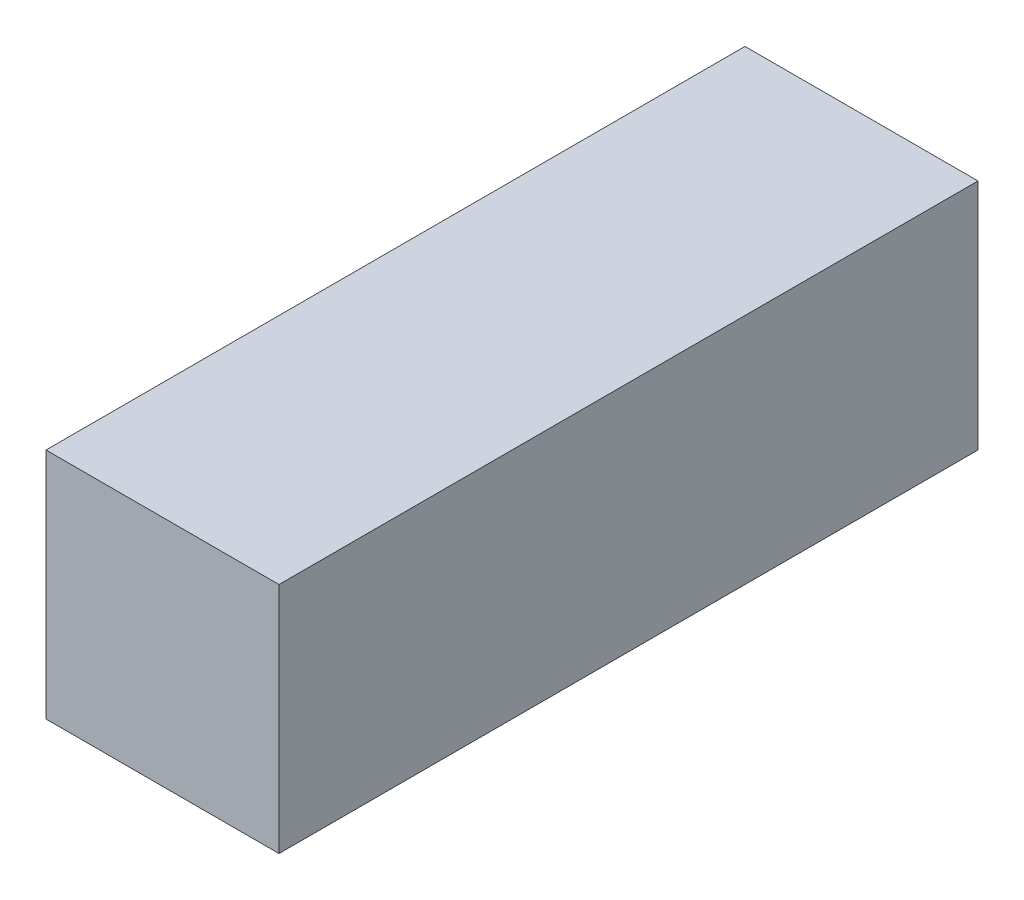
ISO-10303-21;
HEADER;
FILE_DESCRIPTION(('STEP AP214'),'2;1');
FILE_NAME('part.step','',(''),(''),'','','');
FILE_SCHEMA(('AUTOMOTIVE_DESIGN { 1 0 10303 214 1 1 1 1 }'));
ENDSEC;
DATA;
#1=APPLICATION_CONTEXT('core data for automotive mechanical design processes');
#2=APPLICATION_PROTOCOL_DEFINITION('international standard','automotive_design',2000,#1);
#3=PRODUCT_CONTEXT('',#1,'mechanical');
#4=PRODUCT('Part','Part','',(#3));
#5=PRODUCT_RELATED_PRODUCT_CATEGORY('part','',(#4));
#6=PRODUCT_DEFINITION_FORMATION('','',#4);
#7=PRODUCT_DEFINITION_CONTEXT('part definition',#1,'design');
#8=PRODUCT_DEFINITION('design','',#6,#7);
#9=PRODUCT_DEFINITION_SHAPE('','',#8);
#10=(LENGTH_UNIT() NAMED_UNIT(*) SI_UNIT(.MILLI.,.METRE.));
#11=(NAMED_UNIT(*) PLANE_ANGLE_UNIT() SI_UNIT($,.RADIAN.));
#12=(NAMED_UNIT(*) SI_UNIT($,.STERADIAN.) SOLID_ANGLE_UNIT());
#13=UNCERTAINTY_MEASURE_WITH_UNIT(LENGTH_MEASURE(1.E-05),#10,'distance_accuracy_value','');
#14=(GEOMETRIC_REPRESENTATION_CONTEXT(3) GLOBAL_UNCERTAINTY_ASSIGNED_CONTEXT((#13)) GLOBAL_UNIT_ASSIGNED_CONTEXT((#10,
#11,#12)) REPRESENTATION_CONTEXT('',''));
#15=CARTESIAN_POINT('',(0.,0.,0.));
#16=DIRECTION('',(0.,0.,1.));
#17=DIRECTION('',(1.,0.,0.));
#18=AXIS2_PLACEMENT_3D('',#15,#16,#17);
#19=CARTESIAN_POINT('',(5.,10.,-15.));
#20=DIRECTION('',(-1.,0.,0.));
#21=DIRECTION('',(0.,0.,1.));
#22=AXIS2_PLACEMENT_3D('',#19,#20,#21);
#23=PLANE('',#22);
#24=DIRECTION('',(0.,0.,-1.));
#25=VECTOR('',#24,1.);
#26=CARTESIAN_POINT('',(5.,0.,-15.));
#27=LINE('',#26,#25);
#28=CARTESIAN_POINT('',(5.,0.,15.));
#29=VERTEX_POINT('',#28);
#30=CARTESIAN_POINT('',(5.,0.,-15.));
#31=VERTEX_POINT('',#30);
#32=EDGE_CURVE('E96',#29,#31,#27,.T.);
#33=ORIENTED_EDGE('',*,*,#32,.T.);
#34=DIRECTION('',(0.,-1.,0.));
#35=VECTOR('',#34,1.);
#36=CARTESIAN_POINT('',(5.,10.,-15.));
#37=LINE('',#36,#35);
#38=CARTESIAN_POINT('',(5.,10.,-15.));
#39=VERTEX_POINT('',#38);
#40=EDGE_CURVE('E11',#39,#31,#37,.T.);
#41=ORIENTED_EDGE('',*,*,#40,.F.);
#42=DIRECTION('',(0.,0.,-1.));
#43=VECTOR('',#42,1.);
#44=CARTESIAN_POINT('',(5.,10.,-15.));
#45=LINE('',#44,#43);
#46=CARTESIAN_POINT('',(5.,10.,15.));
#47=VERTEX_POINT('',#46);
#48=EDGE_CURVE('E84',#47,#39,#45,.T.);
#49=ORIENTED_EDGE('',*,*,#48,.F.);
#50=DIRECTION('',(0.,-1.,0.));
#51=VECTOR('',#50,1.);
#52=CARTESIAN_POINT('',(5.,10.,15.));
#53=LINE('',#52,#51);
#54=EDGE_CURVE('E92',#47,#29,#53,.T.);
#55=ORIENTED_EDGE('',*,*,#54,.T.);
#56=EDGE_LOOP('',(#33,#41,#49,#55));
#57=FACE_BOUND('',#56,.T.);
#58=ADVANCED_FACE('F33',(#57),#23,.F.);
#59=CARTESIAN_POINT('',(-5.,10.,-15.));
#60=DIRECTION('',(0.,0.,1.));
#61=DIRECTION('',(1.,0.,0.));
#62=AXIS2_PLACEMENT_3D('',#59,#60,#61);
#63=PLANE('',#62);
#64=DIRECTION('',(-1.,0.,0.));
#65=VECTOR('',#64,1.);
#66=CARTESIAN_POINT('',(-5.,0.,-15.));
#67=LINE('',#66,#65);
#68=CARTESIAN_POINT('',(-5.,0.,-15.));
#69=VERTEX_POINT('',#68);
#70=EDGE_CURVE('E88',#31,#69,#67,.T.);
#71=ORIENTED_EDGE('',*,*,#70,.T.);
#72=DIRECTION('',(0.,-1.,0.));
#73=VECTOR('',#72,1.);
#74=CARTESIAN_POINT('',(-5.,10.,-15.));
#75=LINE('',#74,#73);
#76=CARTESIAN_POINT('',(-5.,10.,-15.));
#77=VERTEX_POINT('',#76);
#78=EDGE_CURVE('E41',#77,#69,#75,.T.);
#79=ORIENTED_EDGE('',*,*,#78,.F.);
#80=DIRECTION('',(-1.,0.,0.));
#81=VECTOR('',#80,1.);
#82=CARTESIAN_POINT('',(-5.,10.,-15.));
#83=LINE('',#82,#81);
#84=EDGE_CURVE('E79',#39,#77,#83,.T.);
#85=ORIENTED_EDGE('',*,*,#84,.F.);
#86=ORIENTED_EDGE('',*,*,#40,.T.);
#87=EDGE_LOOP('',(#71,#79,#85,#86));
#88=FACE_BOUND('',#87,.T.);
#89=ADVANCED_FACE('F87',(#88),#63,.F.);
#90=CARTESIAN_POINT('',(-5.,10.,-15.));
#91=DIRECTION('',(1.,0.,0.));
#92=DIRECTION('',(0.,0.,-1.));
#93=AXIS2_PLACEMENT_3D('',#90,#91,#92);
#94=PLANE('',#93);
#95=DIRECTION('',(0.,0.,1.));
#96=VECTOR('',#95,1.);
#97=CARTESIAN_POINT('',(-5.,0.,-15.));
#98=LINE('',#97,#96);
#99=CARTESIAN_POINT('',(-5.,0.,15.));
#100=VERTEX_POINT('',#99);
#101=EDGE_CURVE('E66',#69,#100,#98,.T.);
#102=ORIENTED_EDGE('',*,*,#101,.T.);
#103=DIRECTION('',(0.,-1.,0.));
#104=VECTOR('',#103,1.);
#105=CARTESIAN_POINT('',(-5.,10.,15.));
#106=LINE('',#105,#104);
#107=CARTESIAN_POINT('',(-5.,10.,15.));
#108=VERTEX_POINT('',#107);
#109=EDGE_CURVE('E89',#108,#100,#106,.T.);
#110=ORIENTED_EDGE('',*,*,#109,.F.);
#111=DIRECTION('',(0.,0.,1.));
#112=VECTOR('',#111,1.);
#113=CARTESIAN_POINT('',(-5.,10.,-15.));
#114=LINE('',#113,#112);
#115=EDGE_CURVE('E82',#77,#108,#114,.T.);
#116=ORIENTED_EDGE('',*,*,#115,.F.);
#117=ORIENTED_EDGE('',*,*,#78,.T.);
#118=EDGE_LOOP('',(#102,#110,#116,#117));
#119=FACE_BOUND('',#118,.T.);
#120=ADVANCED_FACE('F90',(#119),#94,.F.);
#121=CARTESIAN_POINT('',(-5.,10.,15.));
#122=DIRECTION('',(0.,0.,-1.));
#123=DIRECTION('',(-1.,0.,0.));
#124=AXIS2_PLACEMENT_3D('',#121,#122,#123);
#125=PLANE('',#124);
#126=DIRECTION('',(1.,0.,0.));
#127=VECTOR('',#126,1.);
#128=CARTESIAN_POINT('',(-5.,0.,15.));
#129=LINE('',#128,#127);
#130=EDGE_CURVE('E72',#100,#29,#129,.T.);
#131=ORIENTED_EDGE('',*,*,#130,.T.);
#132=ORIENTED_EDGE('',*,*,#54,.F.);
#133=DIRECTION('',(1.,0.,0.));
#134=VECTOR('',#133,1.);
#135=CARTESIAN_POINT('',(-5.,10.,15.));
#136=LINE('',#135,#134);
#137=EDGE_CURVE('E49',#108,#47,#136,.T.);
#138=ORIENTED_EDGE('',*,*,#137,.F.);
#139=ORIENTED_EDGE('',*,*,#109,.T.);
#140=EDGE_LOOP('',(#131,#132,#138,#139));
#141=FACE_BOUND('',#140,.T.);
#142=ADVANCED_FACE('F103',(#141),#125,.F.);
#143=CARTESIAN_POINT('',(0.,10.,0.));
#144=DIRECTION('',(0.,1.,0.));
#145=DIRECTION('',(0.,0.,1.));
#146=AXIS2_PLACEMENT_3D('',#143,#144,#145);
#147=PLANE('',#146);
#148=ORIENTED_EDGE('',*,*,#48,.T.);
#149=ORIENTED_EDGE('',*,*,#84,.T.);
#150=ORIENTED_EDGE('',*,*,#115,.T.);
#151=ORIENTED_EDGE('',*,*,#137,.T.);
#152=EDGE_LOOP('',(#148,#149,#150,#151));
#153=FACE_BOUND('',#152,.T.);
#154=ADVANCED_FACE('F80',(#153),#147,.T.);
#155=CARTESIAN_POINT('',(0.,0.,0.));
#156=DIRECTION('',(0.,1.,0.));
#157=DIRECTION('',(0.,0.,1.));
#158=AXIS2_PLACEMENT_3D('',#155,#156,#157);
#159=PLANE('',#158);
#160=ORIENTED_EDGE('',*,*,#32,.F.);
#161=ORIENTED_EDGE('',*,*,#130,.F.);
#162=ORIENTED_EDGE('',*,*,#101,.F.);
#163=ORIENTED_EDGE('',*,*,#70,.F.);
#164=EDGE_LOOP('',(#160,#161,#162,#163));
#165=FACE_BOUND('',#164,.T.);
#166=ADVANCED_FACE('F106',(#165),#159,.F.);
#167=CLOSED_SHELL('',(#58,#89,#120,#142,#154,#166));
#168=MANIFOLD_SOLID_BREP('B2',#167);
#169=ADVANCED_BREP_SHAPE_REPRESENTATION('',(#18,#168),#14);
#170=SHAPE_DEFINITION_REPRESENTATION(#9,#169);
ENDSEC;
END-ISO-10303-21;
